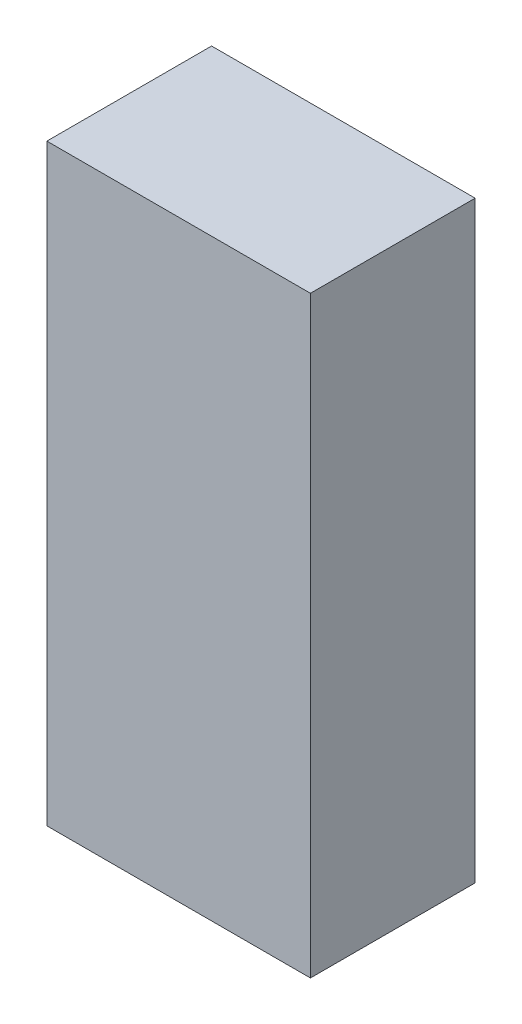
ISO-10303-21;
HEADER;
FILE_DESCRIPTION(('STEP AP214'),'2;1');
FILE_NAME('part.step','',(''),(''),'','','');
FILE_SCHEMA(('AUTOMOTIVE_DESIGN { 1 0 10303 214 1 1 1 1 }'));
ENDSEC;
DATA;
#1=APPLICATION_CONTEXT('core data for automotive mechanical design processes');
#2=APPLICATION_PROTOCOL_DEFINITION('international standard','automotive_design',2000,#1);
#3=PRODUCT_CONTEXT('',#1,'mechanical');
#4=PRODUCT('Part','Part','',(#3));
#5=PRODUCT_RELATED_PRODUCT_CATEGORY('part','',(#4));
#6=PRODUCT_DEFINITION_FORMATION('','',#4);
#7=PRODUCT_DEFINITION_CONTEXT('part definition',#1,'design');
#8=PRODUCT_DEFINITION('design','',#6,#7);
#9=PRODUCT_DEFINITION_SHAPE('','',#8);
#10=(LENGTH_UNIT() NAMED_UNIT(*) SI_UNIT(.MILLI.,.METRE.));
#11=(NAMED_UNIT(*) PLANE_ANGLE_UNIT() SI_UNIT($,.RADIAN.));
#12=(NAMED_UNIT(*) SI_UNIT($,.STERADIAN.) SOLID_ANGLE_UNIT());
#13=UNCERTAINTY_MEASURE_WITH_UNIT(LENGTH_MEASURE(1.E-05),#10,'distance_accuracy_value','');
#14=(GEOMETRIC_REPRESENTATION_CONTEXT(3) GLOBAL_UNCERTAINTY_ASSIGNED_CONTEXT((#13)) GLOBAL_UNIT_ASSIGNED_CONTEXT((#10,
#11,#12)) REPRESENTATION_CONTEXT('',''));
#15=CARTESIAN_POINT('',(0.,0.,0.));
#16=DIRECTION('',(0.,0.,1.));
#17=DIRECTION('',(1.,0.,0.));
#18=AXIS2_PLACEMENT_3D('',#15,#16,#17);
#19=CARTESIAN_POINT('',(-64.5408799530635,17.5406241133122,20.));
#20=DIRECTION('',(1.,0.,0.));
#21=DIRECTION('',(0.,0.,-1.));
#22=AXIS2_PLACEMENT_3D('',#19,#20,#21);
#23=PLANE('',#22);
#24=DIRECTION('',(0.,-1.,0.));
#25=VECTOR('',#24,1.);
#26=CARTESIAN_POINT('',(-64.5408799530635,17.5406241133122,0.));
#27=LINE('',#26,#25);
#28=CARTESIAN_POINT('',(-64.5408799530635,17.5406241133122,0.));
#29=VERTEX_POINT('',#28);
#30=CARTESIAN_POINT('',(-64.5408799530635,-54.4593758866878,0.));
#31=VERTEX_POINT('',#30);
#32=EDGE_CURVE('E107',#29,#31,#27,.T.);
#33=ORIENTED_EDGE('',*,*,#32,.T.);
#34=DIRECTION('',(0.,0.,-1.));
#35=VECTOR('',#34,1.);
#36=CARTESIAN_POINT('',(-64.5408799530635,-54.4593758866878,20.));
#37=LINE('',#36,#35);
#38=CARTESIAN_POINT('',(-64.5408799530635,-54.4593758866878,20.));
#39=VERTEX_POINT('',#38);
#40=EDGE_CURVE('E11',#39,#31,#37,.T.);
#41=ORIENTED_EDGE('',*,*,#40,.F.);
#42=DIRECTION('',(0.,-1.,0.));
#43=VECTOR('',#42,1.);
#44=CARTESIAN_POINT('',(-64.5408799530635,17.5406241133122,20.));
#45=LINE('',#44,#43);
#46=CARTESIAN_POINT('',(-64.5408799530635,17.5406241133122,20.));
#47=VERTEX_POINT('',#46);
#48=EDGE_CURVE('E91',#47,#39,#45,.T.);
#49=ORIENTED_EDGE('',*,*,#48,.F.);
#50=DIRECTION('',(0.,0.,-1.));
#51=VECTOR('',#50,1.);
#52=CARTESIAN_POINT('',(-64.5408799530635,17.5406241133122,20.));
#53=LINE('',#52,#51);
#54=EDGE_CURVE('E103',#47,#29,#53,.T.);
#55=ORIENTED_EDGE('',*,*,#54,.T.);
#56=EDGE_LOOP('',(#33,#41,#49,#55));
#57=FACE_BOUND('',#56,.T.);
#58=ADVANCED_FACE('F39',(#57),#23,.F.);
#59=CARTESIAN_POINT('',(-64.5408799530635,-54.4593758866878,20.));
#60=DIRECTION('',(0.,1.,0.));
#61=DIRECTION('',(0.,0.,1.));
#62=AXIS2_PLACEMENT_3D('',#59,#60,#61);
#63=PLANE('',#62);
#64=DIRECTION('',(1.,0.,0.));
#65=VECTOR('',#64,1.);
#66=CARTESIAN_POINT('',(-64.5408799530635,-54.4593758866878,0.));
#67=LINE('',#66,#65);
#68=CARTESIAN_POINT('',(-32.5408799530635,-54.4593758866878,0.));
#69=VERTEX_POINT('',#68);
#70=EDGE_CURVE('E96',#31,#69,#67,.T.);
#71=ORIENTED_EDGE('',*,*,#70,.T.);
#72=DIRECTION('',(0.,0.,-1.));
#73=VECTOR('',#72,1.);
#74=CARTESIAN_POINT('',(-32.5408799530635,-54.4593758866878,20.));
#75=LINE('',#74,#73);
#76=CARTESIAN_POINT('',(-32.5408799530635,-54.4593758866878,20.));
#77=VERTEX_POINT('',#76);
#78=EDGE_CURVE('E48',#77,#69,#75,.T.);
#79=ORIENTED_EDGE('',*,*,#78,.F.);
#80=DIRECTION('',(1.,0.,0.));
#81=VECTOR('',#80,1.);
#82=CARTESIAN_POINT('',(-64.5408799530635,-54.4593758866878,20.));
#83=LINE('',#82,#81);
#84=EDGE_CURVE('E86',#39,#77,#83,.T.);
#85=ORIENTED_EDGE('',*,*,#84,.F.);
#86=ORIENTED_EDGE('',*,*,#40,.T.);
#87=EDGE_LOOP('',(#71,#79,#85,#86));
#88=FACE_BOUND('',#87,.T.);
#89=ADVANCED_FACE('F95',(#88),#63,.F.);
#90=CARTESIAN_POINT('',(-32.5408799530635,17.5406241133122,20.));
#91=DIRECTION('',(-1.,0.,0.));
#92=DIRECTION('',(0.,0.,1.));
#93=AXIS2_PLACEMENT_3D('',#90,#91,#92);
#94=PLANE('',#93);
#95=DIRECTION('',(0.,1.,0.));
#96=VECTOR('',#95,1.);
#97=CARTESIAN_POINT('',(-32.5408799530635,17.5406241133122,0.));
#98=LINE('',#97,#96);
#99=CARTESIAN_POINT('',(-32.5408799530635,17.5406241133122,0.));
#100=VERTEX_POINT('',#99);
#101=EDGE_CURVE('E73',#69,#100,#98,.T.);
#102=ORIENTED_EDGE('',*,*,#101,.T.);
#103=DIRECTION('',(0.,0.,-1.));
#104=VECTOR('',#103,1.);
#105=CARTESIAN_POINT('',(-32.5408799530635,17.5406241133122,20.));
#106=LINE('',#105,#104);
#107=CARTESIAN_POINT('',(-32.5408799530635,17.5406241133122,20.));
#108=VERTEX_POINT('',#107);
#109=EDGE_CURVE('E98',#108,#100,#106,.T.);
#110=ORIENTED_EDGE('',*,*,#109,.F.);
#111=DIRECTION('',(0.,1.,0.));
#112=VECTOR('',#111,1.);
#113=CARTESIAN_POINT('',(-32.5408799530635,17.5406241133122,20.));
#114=LINE('',#113,#112);
#115=EDGE_CURVE('E89',#77,#108,#114,.T.);
#116=ORIENTED_EDGE('',*,*,#115,.F.);
#117=ORIENTED_EDGE('',*,*,#78,.T.);
#118=EDGE_LOOP('',(#102,#110,#116,#117));
#119=FACE_BOUND('',#118,.T.);
#120=ADVANCED_FACE('F99',(#119),#94,.F.);
#121=CARTESIAN_POINT('',(-64.5408799530635,17.5406241133122,20.));
#122=DIRECTION('',(0.,-1.,0.));
#123=DIRECTION('',(0.,0.,-1.));
#124=AXIS2_PLACEMENT_3D('',#121,#122,#123);
#125=PLANE('',#124);
#126=DIRECTION('',(-1.,0.,0.));
#127=VECTOR('',#126,1.);
#128=CARTESIAN_POINT('',(-64.5408799530635,17.5406241133122,0.));
#129=LINE('',#128,#127);
#130=EDGE_CURVE('E79',#100,#29,#129,.T.);
#131=ORIENTED_EDGE('',*,*,#130,.T.);
#132=ORIENTED_EDGE('',*,*,#54,.F.);
#133=DIRECTION('',(-1.,0.,0.));
#134=VECTOR('',#133,1.);
#135=CARTESIAN_POINT('',(-64.5408799530635,17.5406241133122,20.));
#136=LINE('',#135,#134);
#137=EDGE_CURVE('E56',#108,#47,#136,.T.);
#138=ORIENTED_EDGE('',*,*,#137,.F.);
#139=ORIENTED_EDGE('',*,*,#109,.T.);
#140=EDGE_LOOP('',(#131,#132,#138,#139));
#141=FACE_BOUND('',#140,.T.);
#142=ADVANCED_FACE('F120',(#141),#125,.F.);
#143=CARTESIAN_POINT('',(0.,0.,20.));
#144=DIRECTION('',(0.,0.,1.));
#145=DIRECTION('',(1.,0.,0.));
#146=AXIS2_PLACEMENT_3D('',#143,#144,#145);
#147=PLANE('',#146);
#148=ORIENTED_EDGE('',*,*,#48,.T.);
#149=ORIENTED_EDGE('',*,*,#84,.T.);
#150=ORIENTED_EDGE('',*,*,#115,.T.);
#151=ORIENTED_EDGE('',*,*,#137,.T.);
#152=EDGE_LOOP('',(#148,#149,#150,#151));
#153=FACE_BOUND('',#152,.T.);
#154=ADVANCED_FACE('F87',(#153),#147,.T.);
#155=CARTESIAN_POINT('',(0.,0.,0.));
#156=DIRECTION('',(0.,0.,1.));
#157=DIRECTION('',(1.,0.,0.));
#158=AXIS2_PLACEMENT_3D('',#155,#156,#157);
#159=PLANE('',#158);
#160=ORIENTED_EDGE('',*,*,#32,.F.);
#161=ORIENTED_EDGE('',*,*,#130,.F.);
#162=ORIENTED_EDGE('',*,*,#101,.F.);
#163=ORIENTED_EDGE('',*,*,#70,.F.);
#164=EDGE_LOOP('',(#160,#161,#162,#163));
#165=FACE_BOUND('',#164,.T.);
#166=ADVANCED_FACE('F123',(#165),#159,.F.);
#167=CLOSED_SHELL('',(#58,#89,#120,#142,#154,#166));
#168=MANIFOLD_SOLID_BREP('B2',#167);
#169=ADVANCED_BREP_SHAPE_REPRESENTATION('',(#18,#168),#14);
#170=SHAPE_DEFINITION_REPRESENTATION(#9,#169);
ENDSEC;
END-ISO-10303-21;
